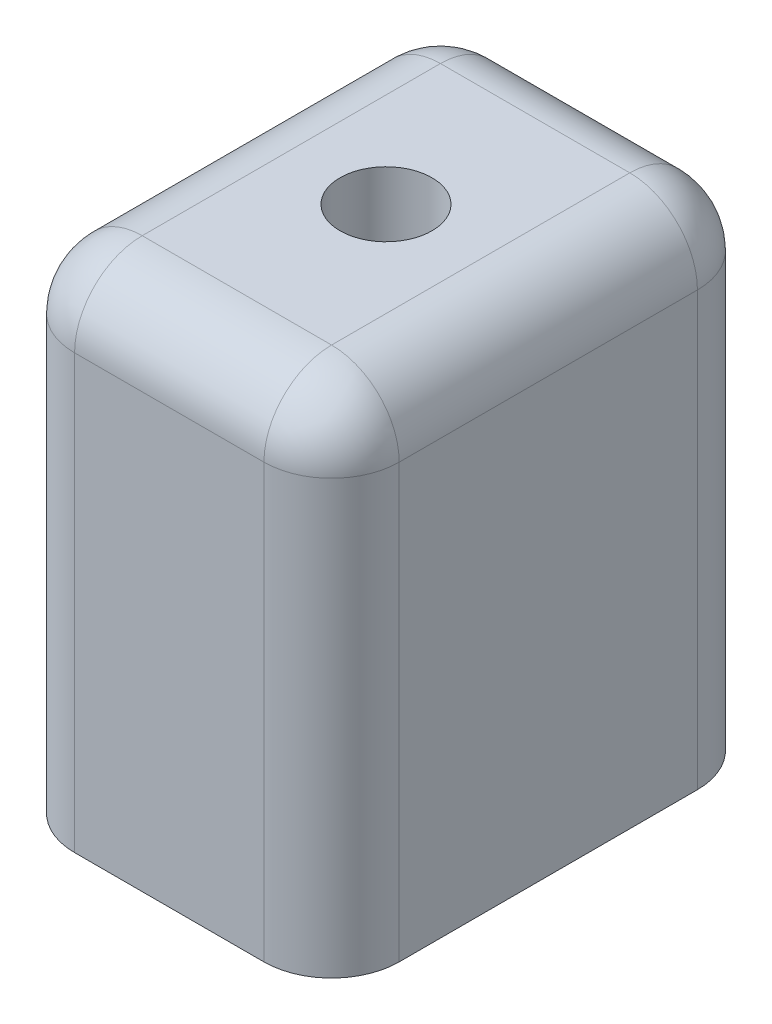
ISO-10303-21;
HEADER;
FILE_DESCRIPTION(('STEP AP214'),'2;1');
FILE_NAME('part.step','',(''),(''),'','','');
FILE_SCHEMA(('AUTOMOTIVE_DESIGN { 1 0 10303 214 1 1 1 1 }'));
ENDSEC;
DATA;
#1=APPLICATION_CONTEXT('core data for automotive mechanical design processes');
#2=APPLICATION_PROTOCOL_DEFINITION('international standard','automotive_design',2000,#1);
#3=PRODUCT_CONTEXT('',#1,'mechanical');
#4=PRODUCT('Part','Part','',(#3));
#5=PRODUCT_RELATED_PRODUCT_CATEGORY('part','',(#4));
#6=PRODUCT_DEFINITION_FORMATION('','',#4);
#7=PRODUCT_DEFINITION_CONTEXT('part definition',#1,'design');
#8=PRODUCT_DEFINITION('design','',#6,#7);
#9=PRODUCT_DEFINITION_SHAPE('','',#8);
#10=(LENGTH_UNIT() NAMED_UNIT(*) SI_UNIT(.MILLI.,.METRE.));
#11=(NAMED_UNIT(*) PLANE_ANGLE_UNIT() SI_UNIT($,.RADIAN.));
#12=(NAMED_UNIT(*) SI_UNIT($,.STERADIAN.) SOLID_ANGLE_UNIT());
#13=UNCERTAINTY_MEASURE_WITH_UNIT(LENGTH_MEASURE(1.E-05),#10,'distance_accuracy_value','');
#14=(GEOMETRIC_REPRESENTATION_CONTEXT(3) GLOBAL_UNCERTAINTY_ASSIGNED_CONTEXT((#13)) GLOBAL_UNIT_ASSIGNED_CONTEXT((#10,
#11,#12)) REPRESENTATION_CONTEXT('',''));
#15=CARTESIAN_POINT('',(0.,0.,0.));
#16=DIRECTION('',(0.,0.,1.));
#17=DIRECTION('',(1.,0.,0.));
#18=AXIS2_PLACEMENT_3D('',#15,#16,#17);
#19=CARTESIAN_POINT('',(5.05617755887286,37.,-9.02050212405651));
#20=DIRECTION('',(0.,-1.,0.));
#21=DIRECTION('',(0.,0.,-1.));
#22=AXIS2_PLACEMENT_3D('',#19,#20,#21);
#23=CYLINDRICAL_SURFACE('',#22,2.15);
#24=CARTESIAN_POINT('',(5.05617755887286,0.,-9.02050212405651));
#25=DIRECTION('',(0.,1.,0.));
#26=DIRECTION('',(0.,0.,1.));
#27=AXIS2_PLACEMENT_3D('',#24,#25,#26);
#28=CIRCLE('',#27,2.15);
#29=CARTESIAN_POINT('',(5.05617755887286,0.,-6.87050212405651));
#30=VERTEX_POINT('',#29);
#31=EDGE_CURVE('E365',#30,#30,#28,.T.);
#32=ORIENTED_EDGE('',*,*,#31,.F.);
#33=EDGE_LOOP('',(#32));
#34=FACE_BOUND('',#33,.T.);
#35=CARTESIAN_POINT('',(5.05617755887286,7.,-9.02050212405651));
#36=DIRECTION('',(0.,1.,0.));
#37=DIRECTION('',(0.,0.,1.));
#38=AXIS2_PLACEMENT_3D('',#35,#36,#37);
#39=CIRCLE('',#38,2.15);
#40=CARTESIAN_POINT('',(5.05617755887286,7.,-6.87050212405651));
#41=VERTEX_POINT('',#40);
#42=EDGE_CURVE('E412',#41,#41,#39,.T.);
#43=ORIENTED_EDGE('',*,*,#42,.T.);
#44=EDGE_LOOP('',(#43));
#45=FACE_BOUND('',#44,.T.);
#46=ADVANCED_FACE('F40',(#34,#45),#23,.F.);
#47=CARTESIAN_POINT('',(10.0561775588729,37.,1.85449787594348));
#48=DIRECTION('',(0.,-1.,0.));
#49=DIRECTION('',(0.,0.,-1.));
#50=AXIS2_PLACEMENT_3D('',#47,#48,#49);
#51=CYLINDRICAL_SURFACE('',#50,2.15);
#52=CARTESIAN_POINT('',(10.0561775588729,0.,1.85449787594348));
#53=DIRECTION('',(0.,1.,0.));
#54=DIRECTION('',(0.,0.,1.));
#55=AXIS2_PLACEMENT_3D('',#52,#53,#54);
#56=CIRCLE('',#55,2.15);
#57=CARTESIAN_POINT('',(10.0561775588729,0.,4.00449787594348));
#58=VERTEX_POINT('',#57);
#59=EDGE_CURVE('E396',#58,#58,#56,.T.);
#60=ORIENTED_EDGE('',*,*,#59,.F.);
#61=EDGE_LOOP('',(#60));
#62=FACE_BOUND('',#61,.T.);
#63=CARTESIAN_POINT('',(10.0561775588729,7.,1.85449787594348));
#64=DIRECTION('',(0.,1.,0.));
#65=DIRECTION('',(0.,0.,1.));
#66=AXIS2_PLACEMENT_3D('',#63,#64,#65);
#67=CIRCLE('',#66,2.15);
#68=CARTESIAN_POINT('',(10.0561775588729,7.,4.00449787594348));
#69=VERTEX_POINT('',#68);
#70=EDGE_CURVE('E408',#69,#69,#67,.T.);
#71=ORIENTED_EDGE('',*,*,#70,.T.);
#72=EDGE_LOOP('',(#71));
#73=FACE_BOUND('',#72,.T.);
#74=ADVANCED_FACE('F260',(#62,#73),#51,.F.);
#75=CARTESIAN_POINT('',(15.0561775588728,37.,-9.02050212405652));
#76=DIRECTION('',(0.,-1.,0.));
#77=DIRECTION('',(0.,0.,-1.));
#78=AXIS2_PLACEMENT_3D('',#75,#76,#77);
#79=CYLINDRICAL_SURFACE('',#78,2.15);
#80=CARTESIAN_POINT('',(15.0561775588728,0.,-9.02050212405652));
#81=DIRECTION('',(0.,1.,0.));
#82=DIRECTION('',(0.,0.,1.));
#83=AXIS2_PLACEMENT_3D('',#80,#81,#82);
#84=CIRCLE('',#83,2.15);
#85=CARTESIAN_POINT('',(15.0561775588728,0.,-6.87050212405652));
#86=VERTEX_POINT('',#85);
#87=EDGE_CURVE('E388',#86,#86,#84,.T.);
#88=ORIENTED_EDGE('',*,*,#87,.F.);
#89=EDGE_LOOP('',(#88));
#90=FACE_BOUND('',#89,.T.);
#91=CARTESIAN_POINT('',(15.0561775588728,7.,-9.02050212405652));
#92=DIRECTION('',(0.,1.,0.));
#93=DIRECTION('',(0.,0.,1.));
#94=AXIS2_PLACEMENT_3D('',#91,#92,#93);
#95=CIRCLE('',#94,2.15);
#96=CARTESIAN_POINT('',(15.0561775588728,7.,-6.87050212405652));
#97=VERTEX_POINT('',#96);
#98=EDGE_CURVE('E404',#97,#97,#95,.T.);
#99=ORIENTED_EDGE('',*,*,#98,.T.);
#100=EDGE_LOOP('',(#99));
#101=FACE_BOUND('',#100,.T.);
#102=ADVANCED_FACE('F266',(#90,#101),#79,.F.);
#103=CARTESIAN_POINT('',(10.0561775588729,37.,-19.8955021240565));
#104=DIRECTION('',(0.,-1.,0.));
#105=DIRECTION('',(0.,0.,-1.));
#106=AXIS2_PLACEMENT_3D('',#103,#104,#105);
#107=CYLINDRICAL_SURFACE('',#106,2.15);
#108=CARTESIAN_POINT('',(10.0561775588729,0.,-19.8955021240565));
#109=DIRECTION('',(0.,1.,0.));
#110=DIRECTION('',(0.,0.,1.));
#111=AXIS2_PLACEMENT_3D('',#108,#109,#110);
#112=CIRCLE('',#111,2.15);
#113=CARTESIAN_POINT('',(10.0561775588729,0.,-17.7455021240565));
#114=VERTEX_POINT('',#113);
#115=EDGE_CURVE('E392',#114,#114,#112,.T.);
#116=ORIENTED_EDGE('',*,*,#115,.F.);
#117=EDGE_LOOP('',(#116));
#118=FACE_BOUND('',#117,.T.);
#119=CARTESIAN_POINT('',(10.0561775588729,7.,-19.8955021240565));
#120=DIRECTION('',(0.,1.,0.));
#121=DIRECTION('',(0.,0.,1.));
#122=AXIS2_PLACEMENT_3D('',#119,#120,#121);
#123=CIRCLE('',#122,2.15);
#124=CARTESIAN_POINT('',(10.0561775588729,7.,-17.7455021240565));
#125=VERTEX_POINT('',#124);
#126=EDGE_CURVE('E400',#125,#125,#123,.T.);
#127=ORIENTED_EDGE('',*,*,#126,.T.);
#128=EDGE_LOOP('',(#127));
#129=FACE_BOUND('',#128,.T.);
#130=ADVANCED_FACE('F277',(#118,#129),#107,.F.);
#131=CARTESIAN_POINT('',(0.,37.,0.));
#132=DIRECTION('',(0.,1.,0.));
#133=DIRECTION('',(0.,0.,1.));
#134=AXIS2_PLACEMENT_3D('',#131,#132,#133);
#135=PLANE('',#134);
#136=DIRECTION('',(0.,0.,-1.));
#137=VECTOR('',#136,1.);
#138=CARTESIAN_POINT('',(17.0561775588729,37.,-25.0455021240565));
#139=LINE('',#138,#137);
#140=CARTESIAN_POINT('',(17.0561775588729,37.,2.00449787594348));
#141=VERTEX_POINT('',#140);
#142=CARTESIAN_POINT('',(17.0561775588729,37.,-20.0455021240565));
#143=VERTEX_POINT('',#142);
#144=EDGE_CURVE('E155',#141,#143,#139,.T.);
#145=ORIENTED_EDGE('',*,*,#144,.T.);
#146=DIRECTION('',(-1.,0.,0.));
#147=VECTOR('',#146,1.);
#148=CARTESIAN_POINT('',(-1.94382244112714,37.,-20.0455021240565));
#149=LINE('',#148,#147);
#150=CARTESIAN_POINT('',(3.05617755887286,37.,-20.0455021240565));
#151=VERTEX_POINT('',#150);
#152=EDGE_CURVE('E123',#143,#151,#149,.T.);
#153=ORIENTED_EDGE('',*,*,#152,.T.);
#154=DIRECTION('',(0.,0.,1.));
#155=VECTOR('',#154,1.);
#156=CARTESIAN_POINT('',(3.05617755887286,37.,7.00449787594348));
#157=LINE('',#156,#155);
#158=CARTESIAN_POINT('',(3.05617755887286,37.,2.00449787594348));
#159=VERTEX_POINT('',#158);
#160=EDGE_CURVE('E142',#151,#159,#157,.T.);
#161=ORIENTED_EDGE('',*,*,#160,.T.);
#162=DIRECTION('',(1.,0.,0.));
#163=VECTOR('',#162,1.);
#164=CARTESIAN_POINT('',(22.0561775588729,37.,2.00449787594348));
#165=LINE('',#164,#163);
#166=EDGE_CURVE('E149',#159,#141,#165,.T.);
#167=ORIENTED_EDGE('',*,*,#166,.T.);
#168=EDGE_LOOP('',(#145,#153,#161,#167));
#169=FACE_BOUND('',#168,.T.);
#170=CARTESIAN_POINT('',(10.0561775588729,37.,-9.02050212405652));
#171=DIRECTION('',(0.,1.,0.));
#172=DIRECTION('',(0.,0.,1.));
#173=AXIS2_PLACEMENT_3D('',#170,#171,#172);
#174=CIRCLE('',#173,3.4);
#175=CARTESIAN_POINT('',(10.0561775588729,37.,-5.62050212405652));
#176=VERTEX_POINT('',#175);
#177=EDGE_CURVE('E242',#176,#176,#174,.T.);
#178=ORIENTED_EDGE('',*,*,#177,.F.);
#179=EDGE_LOOP('',(#178));
#180=FACE_BOUND('',#179,.T.);
#181=ADVANCED_FACE('F152',(#169,#180),#135,.T.);
#182=CARTESIAN_POINT('',(0.,0.,0.));
#183=DIRECTION('',(0.,1.,0.));
#184=DIRECTION('',(0.,0.,1.));
#185=AXIS2_PLACEMENT_3D('',#182,#183,#184);
#186=PLANE('',#185);
#187=DIRECTION('',(0.,0.,-1.));
#188=VECTOR('',#187,1.);
#189=CARTESIAN_POINT('',(22.0561775588729,0.,-25.0455021240565));
#190=LINE('',#189,#188);
#191=CARTESIAN_POINT('',(22.0561775588729,0.,2.00449787594348));
#192=VERTEX_POINT('',#191);
#193=CARTESIAN_POINT('',(22.0561775588729,0.,-20.0455021240565));
#194=VERTEX_POINT('',#193);
#195=EDGE_CURVE('E356',#192,#194,#190,.T.);
#196=ORIENTED_EDGE('',*,*,#195,.F.);
#197=CARTESIAN_POINT('',(17.0561775588729,0.,2.00449787594348));
#198=DIRECTION('',(0.,1.,0.));
#199=DIRECTION('',(0.,0.,1.));
#200=AXIS2_PLACEMENT_3D('',#197,#198,#199);
#201=CIRCLE('',#200,5.);
#202=CARTESIAN_POINT('',(17.0561775588729,0.,7.00449787594348));
#203=VERTEX_POINT('',#202);
#204=EDGE_CURVE('E205',#192,#203,#201,.F.);
#205=ORIENTED_EDGE('',*,*,#204,.T.);
#206=DIRECTION('',(1.,0.,0.));
#207=VECTOR('',#206,1.);
#208=CARTESIAN_POINT('',(-1.94382244112714,0.,7.00449787594348));
#209=LINE('',#208,#207);
#210=CARTESIAN_POINT('',(3.05617755887286,0.,7.00449787594348));
#211=VERTEX_POINT('',#210);
#212=EDGE_CURVE('E353',#211,#203,#209,.T.);
#213=ORIENTED_EDGE('',*,*,#212,.F.);
#214=CARTESIAN_POINT('',(3.05617755887286,0.,2.00449787594348));
#215=DIRECTION('',(0.,1.,0.));
#216=DIRECTION('',(0.,0.,1.));
#217=AXIS2_PLACEMENT_3D('',#214,#215,#216);
#218=CIRCLE('',#217,5.);
#219=CARTESIAN_POINT('',(-1.94382244112714,0.,2.00449787594348));
#220=VERTEX_POINT('',#219);
#221=EDGE_CURVE('E202',#211,#220,#218,.F.);
#222=ORIENTED_EDGE('',*,*,#221,.T.);
#223=DIRECTION('',(0.,0.,1.));
#224=VECTOR('',#223,1.);
#225=CARTESIAN_POINT('',(-1.94382244112714,0.,-25.0455021240565));
#226=LINE('',#225,#224);
#227=CARTESIAN_POINT('',(-1.94382244112714,0.,-20.0455021240565));
#228=VERTEX_POINT('',#227);
#229=EDGE_CURVE('E360',#228,#220,#226,.T.);
#230=ORIENTED_EDGE('',*,*,#229,.F.);
#231=CARTESIAN_POINT('',(3.05617755887286,0.,-20.0455021240565));
#232=DIRECTION('',(0.,1.,0.));
#233=DIRECTION('',(0.,0.,1.));
#234=AXIS2_PLACEMENT_3D('',#231,#232,#233);
#235=CIRCLE('',#234,5.);
#236=CARTESIAN_POINT('',(3.05617755887286,0.,-25.0455021240565));
#237=VERTEX_POINT('',#236);
#238=EDGE_CURVE('E199',#228,#237,#235,.F.);
#239=ORIENTED_EDGE('',*,*,#238,.T.);
#240=DIRECTION('',(-1.,0.,0.));
#241=VECTOR('',#240,1.);
#242=CARTESIAN_POINT('',(-1.94382244112714,0.,-25.0455021240565));
#243=LINE('',#242,#241);
#244=CARTESIAN_POINT('',(17.0561775588729,0.,-25.0455021240565));
#245=VERTEX_POINT('',#244);
#246=EDGE_CURVE('E150',#245,#237,#243,.T.);
#247=ORIENTED_EDGE('',*,*,#246,.F.);
#248=CARTESIAN_POINT('',(17.0561775588729,0.,-20.0455021240565));
#249=DIRECTION('',(0.,1.,0.));
#250=DIRECTION('',(0.,0.,1.));
#251=AXIS2_PLACEMENT_3D('',#248,#249,#250);
#252=CIRCLE('',#251,5.);
#253=EDGE_CURVE('E196',#245,#194,#252,.F.);
#254=ORIENTED_EDGE('',*,*,#253,.T.);
#255=EDGE_LOOP('',(#196,#205,#213,#222,#230,#239,#247,#254));
#256=FACE_BOUND('',#255,.T.);
#257=ORIENTED_EDGE('',*,*,#31,.T.);
#258=EDGE_LOOP('',(#257));
#259=FACE_BOUND('',#258,.T.);
#260=ORIENTED_EDGE('',*,*,#87,.T.);
#261=EDGE_LOOP('',(#260));
#262=FACE_BOUND('',#261,.T.);
#263=ORIENTED_EDGE('',*,*,#115,.T.);
#264=EDGE_LOOP('',(#263));
#265=FACE_BOUND('',#264,.T.);
#266=ORIENTED_EDGE('',*,*,#59,.T.);
#267=EDGE_LOOP('',(#266));
#268=FACE_BOUND('',#267,.T.);
#269=ADVANCED_FACE('F276',(#256,#259,#262,#265,#268),#186,.F.);
#270=CARTESIAN_POINT('',(-1.94382244112714,37.,-25.0455021240565));
#271=DIRECTION('',(1.,0.,0.));
#272=DIRECTION('',(0.,0.,-1.));
#273=AXIS2_PLACEMENT_3D('',#270,#271,#272);
#274=PLANE('',#273);
#275=CARTESIAN_POINT('',(-1.94382244112714,4.,-9.02050212405652));
#276=DIRECTION('',(1.,0.,0.));
#277=DIRECTION('',(0.,0.,-1.));
#278=AXIS2_PLACEMENT_3D('',#275,#276,#277);
#279=CIRCLE('',#278,2.75);
#280=CARTESIAN_POINT('',(-1.94382244112714,4.,-11.7705021240565));
#281=VERTEX_POINT('',#280);
#282=EDGE_CURVE('E207',#281,#281,#279,.F.);
#283=ORIENTED_EDGE('',*,*,#282,.F.);
#284=EDGE_LOOP('',(#283));
#285=FACE_BOUND('',#284,.T.);
#286=ORIENTED_EDGE('',*,*,#229,.T.);
#287=DIRECTION('',(0.,-1.,0.));
#288=VECTOR('',#287,1.);
#289=CARTESIAN_POINT('',(-1.94382244112714,37.,2.00449787594348));
#290=LINE('',#289,#288);
#291=CARTESIAN_POINT('',(-1.94382244112714,32.,2.00449787594348));
#292=VERTEX_POINT('',#291);
#293=EDGE_CURVE('E56',#220,#292,#290,.F.);
#294=ORIENTED_EDGE('',*,*,#293,.T.);
#295=DIRECTION('',(0.,0.,1.));
#296=VECTOR('',#295,1.);
#297=CARTESIAN_POINT('',(-1.94382244112714,32.,-25.0455021240565));
#298=LINE('',#297,#296);
#299=CARTESIAN_POINT('',(-1.94382244112714,32.,-20.0455021240565));
#300=VERTEX_POINT('',#299);
#301=EDGE_CURVE('E61',#292,#300,#298,.F.);
#302=ORIENTED_EDGE('',*,*,#301,.T.);
#303=DIRECTION('',(0.,-1.,0.));
#304=VECTOR('',#303,1.);
#305=CARTESIAN_POINT('',(-1.94382244112714,37.,-20.0455021240565));
#306=LINE('',#305,#304);
#307=EDGE_CURVE('E189',#300,#228,#306,.T.);
#308=ORIENTED_EDGE('',*,*,#307,.T.);
#309=EDGE_LOOP('',(#286,#294,#302,#308));
#310=FACE_BOUND('',#309,.T.);
#311=ADVANCED_FACE('F280',(#285,#310),#274,.F.);
#312=CARTESIAN_POINT('',(-1.94382244112714,37.,7.00449787594348));
#313=DIRECTION('',(0.,0.,-1.));
#314=DIRECTION('',(-1.,0.,0.));
#315=AXIS2_PLACEMENT_3D('',#312,#313,#314);
#316=PLANE('',#315);
#317=ORIENTED_EDGE('',*,*,#212,.T.);
#318=DIRECTION('',(0.,-1.,0.));
#319=VECTOR('',#318,1.);
#320=CARTESIAN_POINT('',(17.0561775588729,37.,7.00449787594348));
#321=LINE('',#320,#319);
#322=CARTESIAN_POINT('',(17.0561775588729,32.,7.00449787594348));
#323=VERTEX_POINT('',#322);
#324=EDGE_CURVE('E186',#203,#323,#321,.F.);
#325=ORIENTED_EDGE('',*,*,#324,.T.);
#326=DIRECTION('',(1.,0.,0.));
#327=VECTOR('',#326,1.);
#328=CARTESIAN_POINT('',(-1.94382244112714,32.,7.00449787594348));
#329=LINE('',#328,#327);
#330=CARTESIAN_POINT('',(3.05617755887286,32.,7.00449787594348));
#331=VERTEX_POINT('',#330);
#332=EDGE_CURVE('E183',#323,#331,#329,.F.);
#333=ORIENTED_EDGE('',*,*,#332,.T.);
#334=DIRECTION('',(0.,-1.,0.));
#335=VECTOR('',#334,1.);
#336=CARTESIAN_POINT('',(3.05617755887286,37.,7.00449787594348));
#337=LINE('',#336,#335);
#338=EDGE_CURVE('E180',#331,#211,#337,.T.);
#339=ORIENTED_EDGE('',*,*,#338,.T.);
#340=EDGE_LOOP('',(#317,#325,#333,#339));
#341=FACE_BOUND('',#340,.T.);
#342=ADVANCED_FACE('F290',(#341),#316,.F.);
#343=CARTESIAN_POINT('',(22.0561775588729,37.,-25.0455021240565));
#344=DIRECTION('',(-1.,0.,0.));
#345=DIRECTION('',(0.,0.,1.));
#346=AXIS2_PLACEMENT_3D('',#343,#344,#345);
#347=PLANE('',#346);
#348=DIRECTION('',(0.,0.,-1.));
#349=VECTOR('',#348,1.);
#350=CARTESIAN_POINT('',(22.0561775588729,32.,7.00449787594348));
#351=LINE('',#350,#349);
#352=CARTESIAN_POINT('',(22.0561775588729,32.,-20.0455021240565));
#353=VERTEX_POINT('',#352);
#354=CARTESIAN_POINT('',(22.0561775588729,32.,2.00449787594348));
#355=VERTEX_POINT('',#354);
#356=EDGE_CURVE('E174',#353,#355,#351,.F.);
#357=ORIENTED_EDGE('',*,*,#356,.T.);
#358=DIRECTION('',(0.,-1.,0.));
#359=VECTOR('',#358,1.);
#360=CARTESIAN_POINT('',(22.0561775588729,37.,2.00449787594348));
#361=LINE('',#360,#359);
#362=EDGE_CURVE('E177',#355,#192,#361,.T.);
#363=ORIENTED_EDGE('',*,*,#362,.T.);
#364=ORIENTED_EDGE('',*,*,#195,.T.);
#365=DIRECTION('',(0.,-1.,0.));
#366=VECTOR('',#365,1.);
#367=CARTESIAN_POINT('',(22.0561775588729,37.,-20.0455021240565));
#368=LINE('',#367,#366);
#369=EDGE_CURVE('E171',#194,#353,#368,.F.);
#370=ORIENTED_EDGE('',*,*,#369,.T.);
#371=EDGE_LOOP('',(#357,#363,#364,#370));
#372=FACE_BOUND('',#371,.T.);
#373=ADVANCED_FACE('F286',(#372),#347,.F.);
#374=CARTESIAN_POINT('',(-1.94382244112714,37.,-25.0455021240565));
#375=DIRECTION('',(0.,0.,1.));
#376=DIRECTION('',(1.,0.,0.));
#377=AXIS2_PLACEMENT_3D('',#374,#375,#376);
#378=PLANE('',#377);
#379=ORIENTED_EDGE('',*,*,#246,.T.);
#380=DIRECTION('',(0.,-1.,0.));
#381=VECTOR('',#380,1.);
#382=CARTESIAN_POINT('',(3.05617755887286,37.,-25.0455021240565));
#383=LINE('',#382,#381);
#384=CARTESIAN_POINT('',(3.05617755887286,32.,-25.0455021240565));
#385=VERTEX_POINT('',#384);
#386=EDGE_CURVE('E168',#237,#385,#383,.F.);
#387=ORIENTED_EDGE('',*,*,#386,.T.);
#388=DIRECTION('',(-1.,0.,0.));
#389=VECTOR('',#388,1.);
#390=CARTESIAN_POINT('',(22.0561775588729,32.,-25.0455021240565));
#391=LINE('',#390,#389);
#392=CARTESIAN_POINT('',(17.0561775588729,32.,-25.0455021240565));
#393=VERTEX_POINT('',#392);
#394=EDGE_CURVE('E125',#385,#393,#391,.F.);
#395=ORIENTED_EDGE('',*,*,#394,.T.);
#396=DIRECTION('',(0.,-1.,0.));
#397=VECTOR('',#396,1.);
#398=CARTESIAN_POINT('',(17.0561775588729,37.,-25.0455021240565));
#399=LINE('',#398,#397);
#400=EDGE_CURVE('E158',#393,#245,#399,.T.);
#401=ORIENTED_EDGE('',*,*,#400,.T.);
#402=EDGE_LOOP('',(#379,#387,#395,#401));
#403=FACE_BOUND('',#402,.T.);
#404=ADVANCED_FACE('F282',(#403),#378,.F.);
#405=CARTESIAN_POINT('',(10.0561775588729,7.,-19.8955021240565));
#406=DIRECTION('',(0.,1.,0.));
#407=DIRECTION('',(0.,0.,1.));
#408=AXIS2_PLACEMENT_3D('',#405,#406,#407);
#409=PLANE('',#408);
#410=ORIENTED_EDGE('',*,*,#126,.F.);
#411=EDGE_LOOP('',(#410));
#412=FACE_BOUND('',#411,.T.);
#413=ADVANCED_FACE('F285',(#412),#409,.F.);
#414=CARTESIAN_POINT('',(15.0561775588728,7.,-9.02050212405652));
#415=DIRECTION('',(0.,1.,0.));
#416=DIRECTION('',(0.,0.,1.));
#417=AXIS2_PLACEMENT_3D('',#414,#415,#416);
#418=PLANE('',#417);
#419=ORIENTED_EDGE('',*,*,#98,.F.);
#420=EDGE_LOOP('',(#419));
#421=FACE_BOUND('',#420,.T.);
#422=ADVANCED_FACE('F439',(#421),#418,.F.);
#423=CARTESIAN_POINT('',(10.0561775588729,7.,1.85449787594348));
#424=DIRECTION('',(0.,1.,0.));
#425=DIRECTION('',(0.,0.,1.));
#426=AXIS2_PLACEMENT_3D('',#423,#424,#425);
#427=PLANE('',#426);
#428=ORIENTED_EDGE('',*,*,#70,.F.);
#429=EDGE_LOOP('',(#428));
#430=FACE_BOUND('',#429,.T.);
#431=ADVANCED_FACE('F432',(#430),#427,.F.);
#432=CARTESIAN_POINT('',(5.05617755887286,7.,-9.02050212405651));
#433=DIRECTION('',(0.,1.,0.));
#434=DIRECTION('',(0.,0.,1.));
#435=AXIS2_PLACEMENT_3D('',#432,#433,#434);
#436=PLANE('',#435);
#437=ORIENTED_EDGE('',*,*,#42,.F.);
#438=EDGE_LOOP('',(#437));
#439=FACE_BOUND('',#438,.T.);
#440=ADVANCED_FACE('F426',(#439),#436,.F.);
#441=CARTESIAN_POINT('',(10.0561775588729,25.,-9.02050212405652));
#442=DIRECTION('',(0.,1.,0.));
#443=DIRECTION('',(0.,0.,1.));
#444=AXIS2_PLACEMENT_3D('',#441,#442,#443);
#445=CYLINDRICAL_SURFACE('',#444,3.4);
#446=CARTESIAN_POINT('',(10.0561775588729,25.,-9.02050212405652));
#447=DIRECTION('',(0.,1.,0.));
#448=DIRECTION('',(0.,0.,1.));
#449=AXIS2_PLACEMENT_3D('',#446,#447,#448);
#450=CIRCLE('',#449,3.4);
#451=CARTESIAN_POINT('',(10.0561775588729,25.,-5.62050212405652));
#452=VERTEX_POINT('',#451);
#453=EDGE_CURVE('E416',#452,#452,#450,.T.);
#454=ORIENTED_EDGE('',*,*,#453,.F.);
#455=EDGE_LOOP('',(#454));
#456=FACE_BOUND('',#455,.T.);
#457=ORIENTED_EDGE('',*,*,#177,.T.);
#458=EDGE_LOOP('',(#457));
#459=FACE_BOUND('',#458,.T.);
#460=ADVANCED_FACE('F342',(#456,#459),#445,.F.);
#461=CARTESIAN_POINT('',(10.0561775588729,25.,-9.02050212405652));
#462=DIRECTION('',(0.,1.,0.));
#463=DIRECTION('',(0.,0.,1.));
#464=AXIS2_PLACEMENT_3D('',#461,#462,#463);
#465=PLANE('',#464);
#466=ORIENTED_EDGE('',*,*,#453,.T.);
#467=EDGE_LOOP('',(#466));
#468=FACE_BOUND('',#467,.T.);
#469=ADVANCED_FACE('F337',(#468),#465,.T.);
#470=CARTESIAN_POINT('',(17.0561775588729,37.,2.00449787594348));
#471=DIRECTION('',(0.,-1.,0.));
#472=DIRECTION('',(0.,0.,-1.));
#473=AXIS2_PLACEMENT_3D('',#470,#471,#472);
#474=CYLINDRICAL_SURFACE('',#473,5.);
#475=ORIENTED_EDGE('',*,*,#204,.F.);
#476=ORIENTED_EDGE('',*,*,#362,.F.);
#477=CARTESIAN_POINT('',(17.0561775588729,32.,2.00449787594348));
#478=DIRECTION('',(0.,1.,0.));
#479=DIRECTION('',(0.,0.,1.));
#480=AXIS2_PLACEMENT_3D('',#477,#478,#479);
#481=CIRCLE('',#480,5.);
#482=EDGE_CURVE('E238',#323,#355,#481,.T.);
#483=ORIENTED_EDGE('',*,*,#482,.F.);
#484=ORIENTED_EDGE('',*,*,#324,.F.);
#485=EDGE_LOOP('',(#475,#476,#483,#484));
#486=FACE_BOUND('',#485,.T.);
#487=ADVANCED_FACE('F334',(#486),#474,.T.);
#488=CARTESIAN_POINT('',(0.,32.,2.00449787594348));
#489=DIRECTION('',(-1.,0.,0.));
#490=DIRECTION('',(0.,0.,1.));
#491=AXIS2_PLACEMENT_3D('',#488,#489,#490);
#492=CYLINDRICAL_SURFACE('',#491,5.);
#493=CARTESIAN_POINT('',(3.05617755887286,32.,2.00449787594348));
#494=DIRECTION('',(-1.,0.,0.));
#495=DIRECTION('',(0.,0.,1.));
#496=AXIS2_PLACEMENT_3D('',#493,#494,#495);
#497=CIRCLE('',#496,5.);
#498=EDGE_CURVE('E230',#331,#159,#497,.T.);
#499=ORIENTED_EDGE('',*,*,#498,.F.);
#500=ORIENTED_EDGE('',*,*,#332,.F.);
#501=CARTESIAN_POINT('',(17.0561775588729,32.,2.00449787594348));
#502=DIRECTION('',(1.,0.,0.));
#503=DIRECTION('',(0.,0.,-1.));
#504=AXIS2_PLACEMENT_3D('',#501,#502,#503);
#505=CIRCLE('',#504,5.);
#506=EDGE_CURVE('E234',#141,#323,#505,.T.);
#507=ORIENTED_EDGE('',*,*,#506,.F.);
#508=ORIENTED_EDGE('',*,*,#166,.F.);
#509=EDGE_LOOP('',(#499,#500,#507,#508));
#510=FACE_BOUND('',#509,.T.);
#511=ADVANCED_FACE('F331',(#510),#492,.T.);
#512=CARTESIAN_POINT('',(3.05617755887286,37.,2.00449787594348));
#513=DIRECTION('',(0.,-1.,0.));
#514=DIRECTION('',(0.,0.,-1.));
#515=AXIS2_PLACEMENT_3D('',#512,#513,#514);
#516=CYLINDRICAL_SURFACE('',#515,5.);
#517=ORIENTED_EDGE('',*,*,#221,.F.);
#518=ORIENTED_EDGE('',*,*,#338,.F.);
#519=CARTESIAN_POINT('',(3.05617755887286,32.,2.00449787594348));
#520=DIRECTION('',(0.,1.,0.));
#521=DIRECTION('',(0.,0.,1.));
#522=AXIS2_PLACEMENT_3D('',#519,#520,#521);
#523=CIRCLE('',#522,5.);
#524=EDGE_CURVE('E226',#292,#331,#523,.T.);
#525=ORIENTED_EDGE('',*,*,#524,.F.);
#526=ORIENTED_EDGE('',*,*,#293,.F.);
#527=EDGE_LOOP('',(#517,#518,#525,#526));
#528=FACE_BOUND('',#527,.T.);
#529=ADVANCED_FACE('F327',(#528),#516,.T.);
#530=CARTESIAN_POINT('',(17.0561775588729,32.,2.00449787594348));
#531=DIRECTION('',(0.,0.,1.));
#532=DIRECTION('',(1.,0.,0.));
#533=AXIS2_PLACEMENT_3D('',#530,#531,#532);
#534=SPHERICAL_SURFACE('',#533,5.);
#535=ORIENTED_EDGE('',*,*,#506,.T.);
#536=ORIENTED_EDGE('',*,*,#482,.T.);
#537=CARTESIAN_POINT('',(17.0561775588729,32.,2.00449787594348));
#538=DIRECTION('',(0.,0.,1.));
#539=DIRECTION('',(1.,0.,0.));
#540=AXIS2_PLACEMENT_3D('',#537,#538,#539);
#541=CIRCLE('',#540,5.);
#542=EDGE_CURVE('E222',#141,#355,#541,.F.);
#543=ORIENTED_EDGE('',*,*,#542,.F.);
#544=EDGE_LOOP('',(#535,#536,#543));
#545=FACE_BOUND('',#544,.T.);
#546=ADVANCED_FACE('F323',(#545),#534,.T.);
#547=CARTESIAN_POINT('',(3.05617755887286,32.,2.00449787594348));
#548=DIRECTION('',(0.,0.,1.));
#549=DIRECTION('',(1.,0.,0.));
#550=AXIS2_PLACEMENT_3D('',#547,#548,#549);
#551=SPHERICAL_SURFACE('',#550,5.);
#552=ORIENTED_EDGE('',*,*,#524,.T.);
#553=ORIENTED_EDGE('',*,*,#498,.T.);
#554=CARTESIAN_POINT('',(3.05617755887286,32.,2.00449787594348));
#555=DIRECTION('',(0.,0.,1.));
#556=DIRECTION('',(1.,0.,0.));
#557=AXIS2_PLACEMENT_3D('',#554,#555,#556);
#558=CIRCLE('',#557,5.);
#559=EDGE_CURVE('E145',#292,#159,#558,.F.);
#560=ORIENTED_EDGE('',*,*,#559,.F.);
#561=EDGE_LOOP('',(#552,#553,#560));
#562=FACE_BOUND('',#561,.T.);
#563=ADVANCED_FACE('F319',(#562),#551,.T.);
#564=CARTESIAN_POINT('',(17.0561775588729,37.,-20.0455021240565));
#565=DIRECTION('',(0.,-1.,0.));
#566=DIRECTION('',(0.,0.,-1.));
#567=AXIS2_PLACEMENT_3D('',#564,#565,#566);
#568=CYLINDRICAL_SURFACE('',#567,5.);
#569=ORIENTED_EDGE('',*,*,#253,.F.);
#570=ORIENTED_EDGE('',*,*,#400,.F.);
#571=CARTESIAN_POINT('',(17.0561775588729,32.,-20.0455021240565));
#572=DIRECTION('',(0.,1.,0.));
#573=DIRECTION('',(0.,0.,1.));
#574=AXIS2_PLACEMENT_3D('',#571,#572,#573);
#575=CIRCLE('',#574,5.);
#576=EDGE_CURVE('E216',#353,#393,#575,.T.);
#577=ORIENTED_EDGE('',*,*,#576,.F.);
#578=ORIENTED_EDGE('',*,*,#369,.F.);
#579=EDGE_LOOP('',(#569,#570,#577,#578));
#580=FACE_BOUND('',#579,.T.);
#581=ADVANCED_FACE('F315',(#580),#568,.T.);
#582=CARTESIAN_POINT('',(17.0561775588729,32.,0.));
#583=DIRECTION('',(0.,0.,1.));
#584=DIRECTION('',(1.,0.,0.));
#585=AXIS2_PLACEMENT_3D('',#582,#583,#584);
#586=CYLINDRICAL_SURFACE('',#585,5.);
#587=ORIENTED_EDGE('',*,*,#542,.T.);
#588=ORIENTED_EDGE('',*,*,#356,.F.);
#589=CARTESIAN_POINT('',(17.0561775588729,32.,-20.0455021240565));
#590=DIRECTION('',(0.,0.,-1.));
#591=DIRECTION('',(-1.,0.,0.));
#592=AXIS2_PLACEMENT_3D('',#589,#590,#591);
#593=CIRCLE('',#592,5.);
#594=EDGE_CURVE('E139',#143,#353,#593,.T.);
#595=ORIENTED_EDGE('',*,*,#594,.F.);
#596=ORIENTED_EDGE('',*,*,#144,.F.);
#597=EDGE_LOOP('',(#587,#588,#595,#596));
#598=FACE_BOUND('',#597,.T.);
#599=ADVANCED_FACE('F312',(#598),#586,.T.);
#600=CARTESIAN_POINT('',(3.05617755887286,32.,0.));
#601=DIRECTION('',(0.,0.,-1.));
#602=DIRECTION('',(-1.,0.,0.));
#603=AXIS2_PLACEMENT_3D('',#600,#601,#602);
#604=CYLINDRICAL_SURFACE('',#603,5.);
#605=ORIENTED_EDGE('',*,*,#559,.T.);
#606=ORIENTED_EDGE('',*,*,#160,.F.);
#607=CARTESIAN_POINT('',(3.05617755887286,32.,-20.0455021240565));
#608=DIRECTION('',(0.,0.,-1.));
#609=DIRECTION('',(-1.,0.,0.));
#610=AXIS2_PLACEMENT_3D('',#607,#608,#609);
#611=CIRCLE('',#610,5.);
#612=EDGE_CURVE('E132',#300,#151,#611,.T.);
#613=ORIENTED_EDGE('',*,*,#612,.F.);
#614=ORIENTED_EDGE('',*,*,#301,.F.);
#615=EDGE_LOOP('',(#605,#606,#613,#614));
#616=FACE_BOUND('',#615,.T.);
#617=ADVANCED_FACE('F143',(#616),#604,.T.);
#618=CARTESIAN_POINT('',(3.05617755887286,37.,-20.0455021240565));
#619=DIRECTION('',(0.,-1.,0.));
#620=DIRECTION('',(0.,0.,-1.));
#621=AXIS2_PLACEMENT_3D('',#618,#619,#620);
#622=CYLINDRICAL_SURFACE('',#621,5.);
#623=ORIENTED_EDGE('',*,*,#238,.F.);
#624=ORIENTED_EDGE('',*,*,#307,.F.);
#625=CARTESIAN_POINT('',(3.05617755887286,32.,-20.0455021240565));
#626=DIRECTION('',(0.,1.,0.));
#627=DIRECTION('',(0.,0.,1.));
#628=AXIS2_PLACEMENT_3D('',#625,#626,#627);
#629=CIRCLE('',#628,5.);
#630=EDGE_CURVE('E136',#385,#300,#629,.T.);
#631=ORIENTED_EDGE('',*,*,#630,.F.);
#632=ORIENTED_EDGE('',*,*,#386,.F.);
#633=EDGE_LOOP('',(#623,#624,#631,#632));
#634=FACE_BOUND('',#633,.T.);
#635=ADVANCED_FACE('F305',(#634),#622,.T.);
#636=CARTESIAN_POINT('',(17.0561775588729,32.,-20.0455021240565));
#637=DIRECTION('',(1.,0.,0.));
#638=DIRECTION('',(0.,0.,-1.));
#639=AXIS2_PLACEMENT_3D('',#636,#637,#638);
#640=SPHERICAL_SURFACE('',#639,5.);
#641=ORIENTED_EDGE('',*,*,#594,.T.);
#642=ORIENTED_EDGE('',*,*,#576,.T.);
#643=CARTESIAN_POINT('',(17.0561775588729,32.,-20.0455021240565));
#644=DIRECTION('',(1.,0.,0.));
#645=DIRECTION('',(0.,0.,-1.));
#646=AXIS2_PLACEMENT_3D('',#643,#644,#645);
#647=CIRCLE('',#646,5.);
#648=EDGE_CURVE('E129',#143,#393,#647,.F.);
#649=ORIENTED_EDGE('',*,*,#648,.F.);
#650=EDGE_LOOP('',(#641,#642,#649));
#651=FACE_BOUND('',#650,.T.);
#652=ADVANCED_FACE('F302',(#651),#640,.T.);
#653=CARTESIAN_POINT('',(3.05617755887286,32.,-20.0455021240565));
#654=DIRECTION('',(-1.,0.,0.));
#655=DIRECTION('',(0.,0.,1.));
#656=AXIS2_PLACEMENT_3D('',#653,#654,#655);
#657=SPHERICAL_SURFACE('',#656,5.);
#658=ORIENTED_EDGE('',*,*,#630,.T.);
#659=ORIENTED_EDGE('',*,*,#612,.T.);
#660=CARTESIAN_POINT('',(3.05617755887286,32.,-20.0455021240565));
#661=DIRECTION('',(-1.,0.,0.));
#662=DIRECTION('',(0.,0.,1.));
#663=AXIS2_PLACEMENT_3D('',#660,#661,#662);
#664=CIRCLE('',#663,5.);
#665=EDGE_CURVE('E119',#385,#151,#664,.F.);
#666=ORIENTED_EDGE('',*,*,#665,.F.);
#667=EDGE_LOOP('',(#658,#659,#666));
#668=FACE_BOUND('',#667,.T.);
#669=ADVANCED_FACE('F134',(#668),#657,.T.);
#670=CARTESIAN_POINT('',(0.,32.,-20.0455021240565));
#671=DIRECTION('',(1.,0.,0.));
#672=DIRECTION('',(0.,0.,-1.));
#673=AXIS2_PLACEMENT_3D('',#670,#671,#672);
#674=CYLINDRICAL_SURFACE('',#673,5.);
#675=ORIENTED_EDGE('',*,*,#648,.T.);
#676=ORIENTED_EDGE('',*,*,#394,.F.);
#677=ORIENTED_EDGE('',*,*,#665,.T.);
#678=ORIENTED_EDGE('',*,*,#152,.F.);
#679=EDGE_LOOP('',(#675,#676,#677,#678));
#680=FACE_BOUND('',#679,.T.);
#681=ADVANCED_FACE('F121',(#680),#674,.T.);
#682=CARTESIAN_POINT('',(-6.94382244112714,4.,-9.02050212405652));
#683=DIRECTION('',(1.,0.,0.));
#684=DIRECTION('',(0.,0.,-1.));
#685=AXIS2_PLACEMENT_3D('',#682,#683,#684);
#686=CYLINDRICAL_SURFACE('',#685,2.75);
#687=CARTESIAN_POINT('',(-5.44382244112714,4.,-9.02050212405652));
#688=DIRECTION('',(-1.,0.,0.));
#689=DIRECTION('',(0.,0.,1.));
#690=AXIS2_PLACEMENT_3D('',#687,#688,#689);
#691=CIRCLE('',#690,2.75);
#692=CARTESIAN_POINT('',(-5.44382244112714,4.,-6.27050212405652));
#693=VERTEX_POINT('',#692);
#694=EDGE_CURVE('E11',#693,#693,#691,.F.);
#695=ORIENTED_EDGE('',*,*,#694,.T.);
#696=EDGE_LOOP('',(#695));
#697=FACE_BOUND('',#696,.T.);
#698=ORIENTED_EDGE('',*,*,#282,.T.);
#699=EDGE_LOOP('',(#698));
#700=FACE_BOUND('',#699,.T.);
#701=ADVANCED_FACE('F256',(#697,#700),#686,.T.);
#702=CARTESIAN_POINT('',(-6.94382244112714,4.,-9.02050212405652));
#703=DIRECTION('',(-1.,0.,0.));
#704=DIRECTION('',(0.,0.,1.));
#705=AXIS2_PLACEMENT_3D('',#702,#703,#704);
#706=PLANE('',#705);
#707=CARTESIAN_POINT('',(-6.94382244112714,4.,-9.02050212405652));
#708=DIRECTION('',(-1.,0.,0.));
#709=DIRECTION('',(0.,0.,1.));
#710=AXIS2_PLACEMENT_3D('',#707,#708,#709);
#711=CIRCLE('',#710,1.25);
#712=CARTESIAN_POINT('',(-6.94382244112714,4.,-7.77050212405652));
#713=VERTEX_POINT('',#712);
#714=EDGE_CURVE('E49',#713,#713,#711,.T.);
#715=ORIENTED_EDGE('',*,*,#714,.T.);
#716=EDGE_LOOP('',(#715));
#717=FACE_BOUND('',#716,.T.);
#718=ADVANCED_FACE('F249',(#717),#706,.T.);
#719=CARTESIAN_POINT('',(-5.44382244112714,4.,-9.02050212405652));
#720=DIRECTION('',(-1.,0.,0.));
#721=DIRECTION('',(0.,0.,1.));
#722=AXIS2_PLACEMENT_3D('',#719,#720,#721);
#723=DEGENERATE_TOROIDAL_SURFACE('',#722,1.25,1.5,.T.);
#724=ORIENTED_EDGE('',*,*,#694,.F.);
#725=EDGE_LOOP('',(#724));
#726=FACE_BOUND('',#725,.T.);
#727=ORIENTED_EDGE('',*,*,#714,.F.);
#728=EDGE_LOOP('',(#727));
#729=FACE_BOUND('',#728,.T.);
#730=ADVANCED_FACE('F42',(#726,#729),#723,.T.);
#731=CLOSED_SHELL('',(#46,#74,#102,#130,#181,#269,#311,#342,#373,#404,#413,#422,#431,#440,#460,
#469,#487,#511,#529,#546,#563,#581,#599,#617,#635,#652,#669,#681,#701,#718,#730));
#732=MANIFOLD_SOLID_BREP('B2',#731);
#733=ADVANCED_BREP_SHAPE_REPRESENTATION('',(#18,#732),#14);
#734=SHAPE_DEFINITION_REPRESENTATION(#9,#733);
ENDSEC;
END-ISO-10303-21;
